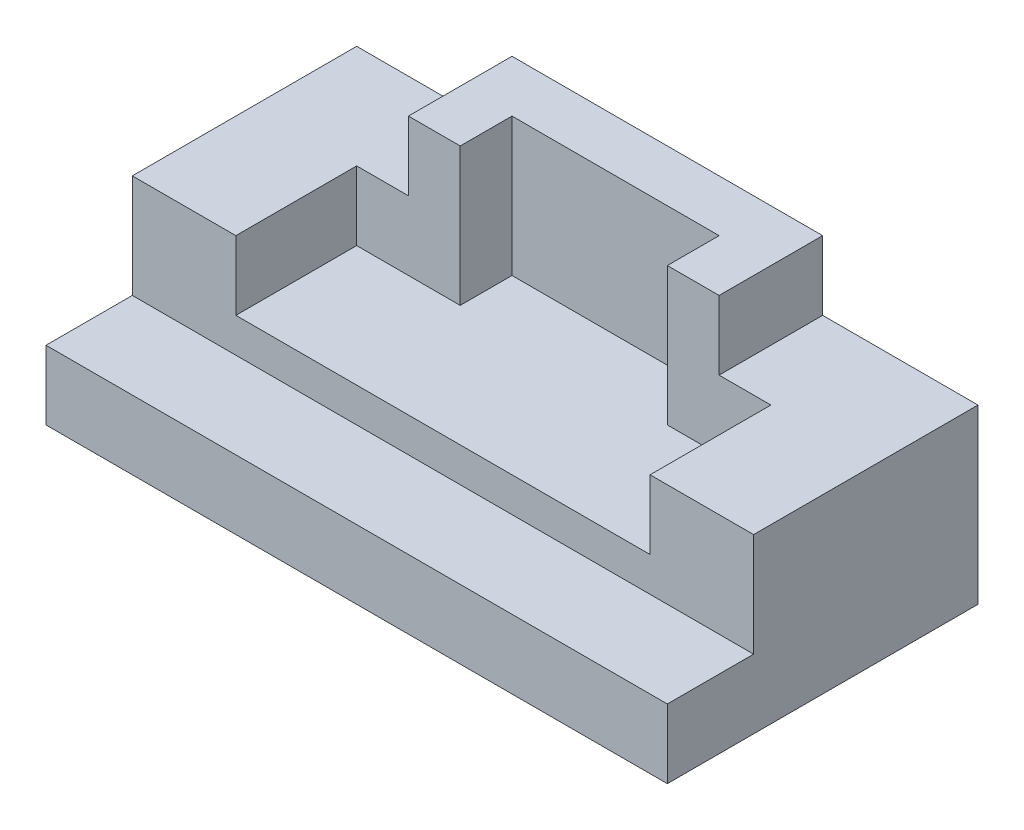
ISO-10303-21;
HEADER;
FILE_DESCRIPTION(('STEP AP214'),'2;1');
FILE_NAME('part.step','',(''),(''),'','','');
FILE_SCHEMA(('AUTOMOTIVE_DESIGN { 1 0 10303 214 1 1 1 1 }'));
ENDSEC;
DATA;
#1=APPLICATION_CONTEXT('core data for automotive mechanical design processes');
#2=APPLICATION_PROTOCOL_DEFINITION('international standard','automotive_design',2000,#1);
#3=PRODUCT_CONTEXT('',#1,'mechanical');
#4=PRODUCT('Part','Part','',(#3));
#5=PRODUCT_RELATED_PRODUCT_CATEGORY('part','',(#4));
#6=PRODUCT_DEFINITION_FORMATION('','',#4);
#7=PRODUCT_DEFINITION_CONTEXT('part definition',#1,'design');
#8=PRODUCT_DEFINITION('design','',#6,#7);
#9=PRODUCT_DEFINITION_SHAPE('','',#8);
#10=(LENGTH_UNIT() NAMED_UNIT(*) SI_UNIT(.MILLI.,.METRE.));
#11=(NAMED_UNIT(*) PLANE_ANGLE_UNIT() SI_UNIT($,.RADIAN.));
#12=(NAMED_UNIT(*) SI_UNIT($,.STERADIAN.) SOLID_ANGLE_UNIT());
#13=UNCERTAINTY_MEASURE_WITH_UNIT(LENGTH_MEASURE(1.E-05),#10,'distance_accuracy_value','');
#14=(GEOMETRIC_REPRESENTATION_CONTEXT(3) GLOBAL_UNCERTAINTY_ASSIGNED_CONTEXT((#13)) GLOBAL_UNIT_ASSIGNED_CONTEXT((#10,
#11,#12)) REPRESENTATION_CONTEXT('',''));
#15=CARTESIAN_POINT('',(0.,0.,0.));
#16=DIRECTION('',(0.,0.,1.));
#17=DIRECTION('',(1.,0.,0.));
#18=AXIS2_PLACEMENT_3D('',#15,#16,#17);
#19=CARTESIAN_POINT('',(57.15,31.75,-28.575));
#20=DIRECTION('',(0.,-1.,0.));
#21=DIRECTION('',(0.,0.,-1.));
#22=AXIS2_PLACEMENT_3D('',#19,#20,#21);
#23=PLANE('',#22);
#24=DIRECTION('',(0.,0.,-1.));
#25=VECTOR('',#24,1.);
#26=CARTESIAN_POINT('',(28.575,31.75,-28.575));
#27=LINE('',#26,#25);
#28=CARTESIAN_POINT('',(28.575,31.75,-9.52500000000001));
#29=VERTEX_POINT('',#28);
#30=CARTESIAN_POINT('',(28.575,31.75,-28.575));
#31=VERTEX_POINT('',#30);
#32=EDGE_CURVE('E224',#29,#31,#27,.T.);
#33=ORIENTED_EDGE('',*,*,#32,.F.);
#34=DIRECTION('',(1.,0.,0.));
#35=VECTOR('',#34,1.);
#36=CARTESIAN_POINT('',(57.15,31.75,-9.52500000000001));
#37=LINE('',#36,#35);
#38=CARTESIAN_POINT('',(38.1,31.75,-9.52500000000001));
#39=VERTEX_POINT('',#38);
#40=EDGE_CURVE('E211',#29,#39,#37,.T.);
#41=ORIENTED_EDGE('',*,*,#40,.T.);
#42=DIRECTION('',(0.,0.,1.));
#43=VECTOR('',#42,1.);
#44=CARTESIAN_POINT('',(38.1,31.75,-28.575));
#45=LINE('',#44,#43);
#46=CARTESIAN_POINT('',(38.1,31.75,12.7));
#47=VERTEX_POINT('',#46);
#48=EDGE_CURVE('E217',#39,#47,#45,.T.);
#49=ORIENTED_EDGE('',*,*,#48,.T.);
#50=DIRECTION('',(-1.,0.,0.));
#51=VECTOR('',#50,1.);
#52=CARTESIAN_POINT('',(57.15,31.75,12.7));
#53=LINE('',#52,#51);
#54=CARTESIAN_POINT('',(57.15,31.75,12.7));
#55=VERTEX_POINT('',#54);
#56=EDGE_CURVE('E264',#55,#47,#53,.T.);
#57=ORIENTED_EDGE('',*,*,#56,.F.);
#58=DIRECTION('',(0.,0.,1.));
#59=VECTOR('',#58,1.);
#60=CARTESIAN_POINT('',(57.15,31.75,-28.575));
#61=LINE('',#60,#59);
#62=CARTESIAN_POINT('',(57.15,31.75,-28.575));
#63=VERTEX_POINT('',#62);
#64=EDGE_CURVE('E279',#63,#55,#61,.T.);
#65=ORIENTED_EDGE('',*,*,#64,.F.);
#66=DIRECTION('',(-1.,0.,0.));
#67=VECTOR('',#66,1.);
#68=CARTESIAN_POINT('',(57.15,31.75,-28.575));
#69=LINE('',#68,#67);
#70=EDGE_CURVE('E263',#63,#31,#69,.T.);
#71=ORIENTED_EDGE('',*,*,#70,.T.);
#72=EDGE_LOOP('',(#33,#41,#49,#57,#65,#71));
#73=FACE_BOUND('',#72,.T.);
#74=ADVANCED_FACE('F33',(#73),#23,.F.);
#75=CARTESIAN_POINT('',(-38.1,31.75,12.7));
#76=VERTEX_POINT('',#75);
#77=CARTESIAN_POINT('',(-57.15,31.75,12.7));
#78=VERTEX_POINT('',#77);
#79=EDGE_CURVE('E292',#76,#78,#53,.T.);
#80=ORIENTED_EDGE('',*,*,#79,.F.);
#81=DIRECTION('',(0.,0.,-1.));
#82=VECTOR('',#81,1.);
#83=CARTESIAN_POINT('',(-38.1,31.75,-28.575));
#84=LINE('',#83,#82);
#85=CARTESIAN_POINT('',(-38.1,31.75,-9.52500000000001));
#86=VERTEX_POINT('',#85);
#87=EDGE_CURVE('E214',#76,#86,#84,.T.);
#88=ORIENTED_EDGE('',*,*,#87,.T.);
#89=DIRECTION('',(1.,0.,0.));
#90=VECTOR('',#89,1.);
#91=CARTESIAN_POINT('',(57.15,31.75,-9.52500000000001));
#92=LINE('',#91,#90);
#93=CARTESIAN_POINT('',(-28.575,31.75,-9.52500000000001));
#94=VERTEX_POINT('',#93);
#95=EDGE_CURVE('E202',#86,#94,#92,.T.);
#96=ORIENTED_EDGE('',*,*,#95,.T.);
#97=DIRECTION('',(0.,0.,1.));
#98=VECTOR('',#97,1.);
#99=CARTESIAN_POINT('',(-28.575,31.75,-9.525));
#100=LINE('',#99,#98);
#101=CARTESIAN_POINT('',(-28.575,31.75,-28.575));
#102=VERTEX_POINT('',#101);
#103=EDGE_CURVE('E58',#102,#94,#100,.T.);
#104=ORIENTED_EDGE('',*,*,#103,.F.);
#105=CARTESIAN_POINT('',(-57.15,31.75,-28.575));
#106=VERTEX_POINT('',#105);
#107=EDGE_CURVE('E260',#102,#106,#69,.T.);
#108=ORIENTED_EDGE('',*,*,#107,.T.);
#109=DIRECTION('',(0.,0.,1.));
#110=VECTOR('',#109,1.);
#111=CARTESIAN_POINT('',(-57.15,31.75,-28.575));
#112=LINE('',#111,#110);
#113=EDGE_CURVE('E310',#106,#78,#112,.T.);
#114=ORIENTED_EDGE('',*,*,#113,.T.);
#115=EDGE_LOOP('',(#80,#88,#96,#104,#108,#114));
#116=FACE_BOUND('',#115,.T.);
#117=ADVANCED_FACE('F362',(#116),#23,.F.);
#118=CARTESIAN_POINT('',(57.15,12.7,28.575));
#119=DIRECTION('',(0.,0.,-1.));
#120=DIRECTION('',(0.,1.,0.));
#121=AXIS2_PLACEMENT_3D('',#118,#119,#120);
#122=PLANE('',#121);
#123=DIRECTION('',(0.,-1.,0.));
#124=VECTOR('',#123,1.);
#125=CARTESIAN_POINT('',(-57.15,12.7,28.575));
#126=LINE('',#125,#124);
#127=CARTESIAN_POINT('',(-57.15,12.7,28.575));
#128=VERTEX_POINT('',#127);
#129=CARTESIAN_POINT('',(-57.15,0.,28.575));
#130=VERTEX_POINT('',#129);
#131=EDGE_CURVE('E316',#128,#130,#126,.T.);
#132=ORIENTED_EDGE('',*,*,#131,.T.);
#133=DIRECTION('',(-1.,0.,0.));
#134=VECTOR('',#133,1.);
#135=CARTESIAN_POINT('',(57.15,0.,28.575));
#136=LINE('',#135,#134);
#137=CARTESIAN_POINT('',(57.15,0.,28.575));
#138=VERTEX_POINT('',#137);
#139=EDGE_CURVE('E11',#138,#130,#136,.T.);
#140=ORIENTED_EDGE('',*,*,#139,.F.);
#141=DIRECTION('',(0.,-1.,0.));
#142=VECTOR('',#141,1.);
#143=CARTESIAN_POINT('',(57.15,12.7,28.575));
#144=LINE('',#143,#142);
#145=CARTESIAN_POINT('',(57.15,12.7,28.575));
#146=VERTEX_POINT('',#145);
#147=EDGE_CURVE('E307',#146,#138,#144,.T.);
#148=ORIENTED_EDGE('',*,*,#147,.F.);
#149=DIRECTION('',(-1.,0.,0.));
#150=VECTOR('',#149,1.);
#151=CARTESIAN_POINT('',(57.15,12.7,28.575));
#152=LINE('',#151,#150);
#153=EDGE_CURVE('E297',#146,#128,#152,.T.);
#154=ORIENTED_EDGE('',*,*,#153,.T.);
#155=EDGE_LOOP('',(#132,#140,#148,#154));
#156=FACE_BOUND('',#155,.T.);
#157=ADVANCED_FACE('F35',(#156),#122,.F.);
#158=CARTESIAN_POINT('',(57.15,0.,28.575));
#159=DIRECTION('',(0.,1.,0.));
#160=DIRECTION('',(0.,0.,1.));
#161=AXIS2_PLACEMENT_3D('',#158,#159,#160);
#162=PLANE('',#161);
#163=DIRECTION('',(0.,0.,-1.));
#164=VECTOR('',#163,1.);
#165=CARTESIAN_POINT('',(-57.15,0.,28.575));
#166=LINE('',#165,#164);
#167=CARTESIAN_POINT('',(-57.15,0.,-28.575));
#168=VERTEX_POINT('',#167);
#169=EDGE_CURVE('E314',#130,#168,#166,.T.);
#170=ORIENTED_EDGE('',*,*,#169,.T.);
#171=DIRECTION('',(-1.,0.,0.));
#172=VECTOR('',#171,1.);
#173=CARTESIAN_POINT('',(57.15,0.,-28.575));
#174=LINE('',#173,#172);
#175=CARTESIAN_POINT('',(57.15,0.,-28.575));
#176=VERTEX_POINT('',#175);
#177=EDGE_CURVE('E42',#176,#168,#174,.T.);
#178=ORIENTED_EDGE('',*,*,#177,.F.);
#179=DIRECTION('',(0.,0.,-1.));
#180=VECTOR('',#179,1.);
#181=CARTESIAN_POINT('',(57.15,0.,28.575));
#182=LINE('',#181,#180);
#183=EDGE_CURVE('E325',#138,#176,#182,.T.);
#184=ORIENTED_EDGE('',*,*,#183,.F.);
#185=ORIENTED_EDGE('',*,*,#139,.T.);
#186=EDGE_LOOP('',(#170,#178,#184,#185));
#187=FACE_BOUND('',#186,.T.);
#188=ADVANCED_FACE('F372',(#187),#162,.F.);
#189=CARTESIAN_POINT('',(57.15,0.,-28.575));
#190=DIRECTION('',(0.,0.,1.));
#191=DIRECTION('',(1.,0.,0.));
#192=AXIS2_PLACEMENT_3D('',#189,#190,#191);
#193=PLANE('',#192);
#194=DIRECTION('',(0.,1.,0.));
#195=VECTOR('',#194,1.);
#196=CARTESIAN_POINT('',(-57.15,0.,-28.575));
#197=LINE('',#196,#195);
#198=EDGE_CURVE('E312',#168,#106,#197,.T.);
#199=ORIENTED_EDGE('',*,*,#198,.T.);
#200=ORIENTED_EDGE('',*,*,#107,.F.);
#201=DIRECTION('',(0.,-1.,0.));
#202=VECTOR('',#201,1.);
#203=CARTESIAN_POINT('',(-28.575,44.45,-28.575));
#204=LINE('',#203,#202);
#205=CARTESIAN_POINT('',(-28.575,44.45,-28.575));
#206=VERTEX_POINT('',#205);
#207=EDGE_CURVE('E237',#206,#102,#204,.T.);
#208=ORIENTED_EDGE('',*,*,#207,.F.);
#209=DIRECTION('',(-1.,0.,0.));
#210=VECTOR('',#209,1.);
#211=CARTESIAN_POINT('',(-28.575,44.45,-28.575));
#212=LINE('',#211,#210);
#213=CARTESIAN_POINT('',(28.575,44.45,-28.575));
#214=VERTEX_POINT('',#213);
#215=EDGE_CURVE('E235',#214,#206,#212,.T.);
#216=ORIENTED_EDGE('',*,*,#215,.F.);
#217=DIRECTION('',(0.,-1.,0.));
#218=VECTOR('',#217,1.);
#219=CARTESIAN_POINT('',(28.575,44.45,-28.575));
#220=LINE('',#219,#218);
#221=EDGE_CURVE('E245',#214,#31,#220,.T.);
#222=ORIENTED_EDGE('',*,*,#221,.T.);
#223=ORIENTED_EDGE('',*,*,#70,.F.);
#224=DIRECTION('',(0.,1.,0.));
#225=VECTOR('',#224,1.);
#226=CARTESIAN_POINT('',(57.15,0.,-28.575));
#227=LINE('',#226,#225);
#228=EDGE_CURVE('E323',#176,#63,#227,.T.);
#229=ORIENTED_EDGE('',*,*,#228,.F.);
#230=ORIENTED_EDGE('',*,*,#177,.T.);
#231=EDGE_LOOP('',(#199,#200,#208,#216,#222,#223,#229,#230));
#232=FACE_BOUND('',#231,.T.);
#233=ADVANCED_FACE('F370',(#232),#193,.F.);
#234=CARTESIAN_POINT('',(57.15,31.75,12.7));
#235=DIRECTION('',(0.,0.,-1.));
#236=DIRECTION('',(0.,1.,0.));
#237=AXIS2_PLACEMENT_3D('',#234,#235,#236);
#238=PLANE('',#237);
#239=ORIENTED_EDGE('',*,*,#56,.T.);
#240=DIRECTION('',(0.,1.,0.));
#241=VECTOR('',#240,1.);
#242=CARTESIAN_POINT('',(38.1,19.05,12.7));
#243=LINE('',#242,#241);
#244=CARTESIAN_POINT('',(38.1,19.05,12.7));
#245=VERTEX_POINT('',#244);
#246=EDGE_CURVE('E203',#245,#47,#243,.T.);
#247=ORIENTED_EDGE('',*,*,#246,.F.);
#248=DIRECTION('',(1.,0.,0.));
#249=VECTOR('',#248,1.);
#250=CARTESIAN_POINT('',(38.1,19.05,12.7));
#251=LINE('',#250,#249);
#252=CARTESIAN_POINT('',(-38.1,19.05,12.7));
#253=VERTEX_POINT('',#252);
#254=EDGE_CURVE('E196',#253,#245,#251,.T.);
#255=ORIENTED_EDGE('',*,*,#254,.F.);
#256=DIRECTION('',(0.,1.,0.));
#257=VECTOR('',#256,1.);
#258=CARTESIAN_POINT('',(-38.1,19.05,12.7));
#259=LINE('',#258,#257);
#260=EDGE_CURVE('E205',#253,#76,#259,.T.);
#261=ORIENTED_EDGE('',*,*,#260,.T.);
#262=ORIENTED_EDGE('',*,*,#79,.T.);
#263=DIRECTION('',(0.,-1.,0.));
#264=VECTOR('',#263,1.);
#265=CARTESIAN_POINT('',(-57.15,31.75,12.7));
#266=LINE('',#265,#264);
#267=CARTESIAN_POINT('',(-57.15,12.7,12.7));
#268=VERTEX_POINT('',#267);
#269=EDGE_CURVE('E308',#78,#268,#266,.T.);
#270=ORIENTED_EDGE('',*,*,#269,.T.);
#271=DIRECTION('',(-1.,0.,0.));
#272=VECTOR('',#271,1.);
#273=CARTESIAN_POINT('',(57.15,12.7,12.7));
#274=LINE('',#273,#272);
#275=CARTESIAN_POINT('',(57.15,12.7,12.7));
#276=VERTEX_POINT('',#275);
#277=EDGE_CURVE('E293',#276,#268,#274,.T.);
#278=ORIENTED_EDGE('',*,*,#277,.F.);
#279=DIRECTION('',(0.,-1.,0.));
#280=VECTOR('',#279,1.);
#281=CARTESIAN_POINT('',(57.15,31.75,12.7));
#282=LINE('',#281,#280);
#283=EDGE_CURVE('E291',#55,#276,#282,.T.);
#284=ORIENTED_EDGE('',*,*,#283,.F.);
#285=EDGE_LOOP('',(#239,#247,#255,#261,#262,#270,#278,#284));
#286=FACE_BOUND('',#285,.T.);
#287=ADVANCED_FACE('F288',(#286),#238,.F.);
#288=CARTESIAN_POINT('',(57.15,12.7,12.7));
#289=DIRECTION('',(0.,-1.,0.));
#290=DIRECTION('',(0.,0.,-1.));
#291=AXIS2_PLACEMENT_3D('',#288,#289,#290);
#292=PLANE('',#291);
#293=DIRECTION('',(0.,0.,1.));
#294=VECTOR('',#293,1.);
#295=CARTESIAN_POINT('',(-57.15,12.7,12.7));
#296=LINE('',#295,#294);
#297=EDGE_CURVE('E305',#268,#128,#296,.T.);
#298=ORIENTED_EDGE('',*,*,#297,.T.);
#299=ORIENTED_EDGE('',*,*,#153,.F.);
#300=DIRECTION('',(0.,0.,1.));
#301=VECTOR('',#300,1.);
#302=CARTESIAN_POINT('',(57.15,12.7,12.7));
#303=LINE('',#302,#301);
#304=EDGE_CURVE('E302',#276,#146,#303,.T.);
#305=ORIENTED_EDGE('',*,*,#304,.F.);
#306=ORIENTED_EDGE('',*,*,#277,.T.);
#307=EDGE_LOOP('',(#298,#299,#305,#306));
#308=FACE_BOUND('',#307,.T.);
#309=ADVANCED_FACE('F386',(#308),#292,.F.);
#310=CARTESIAN_POINT('',(57.15,0.,0.));
#311=DIRECTION('',(1.,0.,0.));
#312=DIRECTION('',(0.,0.,-1.));
#313=AXIS2_PLACEMENT_3D('',#310,#311,#312);
#314=PLANE('',#313);
#315=ORIENTED_EDGE('',*,*,#147,.T.);
#316=ORIENTED_EDGE('',*,*,#183,.T.);
#317=ORIENTED_EDGE('',*,*,#228,.T.);
#318=ORIENTED_EDGE('',*,*,#64,.T.);
#319=ORIENTED_EDGE('',*,*,#283,.T.);
#320=ORIENTED_EDGE('',*,*,#304,.T.);
#321=EDGE_LOOP('',(#315,#316,#317,#318,#319,#320));
#322=FACE_BOUND('',#321,.T.);
#323=ADVANCED_FACE('F389',(#322),#314,.T.);
#324=CARTESIAN_POINT('',(-57.15,0.,0.));
#325=DIRECTION('',(1.,0.,0.));
#326=DIRECTION('',(0.,0.,-1.));
#327=AXIS2_PLACEMENT_3D('',#324,#325,#326);
#328=PLANE('',#327);
#329=ORIENTED_EDGE('',*,*,#131,.F.);
#330=ORIENTED_EDGE('',*,*,#297,.F.);
#331=ORIENTED_EDGE('',*,*,#269,.F.);
#332=ORIENTED_EDGE('',*,*,#113,.F.);
#333=ORIENTED_EDGE('',*,*,#198,.F.);
#334=ORIENTED_EDGE('',*,*,#169,.F.);
#335=EDGE_LOOP('',(#329,#330,#331,#332,#333,#334));
#336=FACE_BOUND('',#335,.T.);
#337=ADVANCED_FACE('F382',(#336),#328,.F.);
#338=CARTESIAN_POINT('',(-28.575,44.45,-9.525));
#339=DIRECTION('',(1.,0.,0.));
#340=DIRECTION('',(0.,0.,-1.));
#341=AXIS2_PLACEMENT_3D('',#338,#339,#340);
#342=PLANE('',#341);
#343=ORIENTED_EDGE('',*,*,#103,.T.);
#344=DIRECTION('',(0.,-1.,0.));
#345=VECTOR('',#344,1.);
#346=CARTESIAN_POINT('',(-28.575,44.45,-9.525));
#347=LINE('',#346,#345);
#348=CARTESIAN_POINT('',(-28.575,44.45,-9.525));
#349=VERTEX_POINT('',#348);
#350=EDGE_CURVE('E319',#349,#94,#347,.T.);
#351=ORIENTED_EDGE('',*,*,#350,.F.);
#352=DIRECTION('',(0.,0.,1.));
#353=VECTOR('',#352,1.);
#354=CARTESIAN_POINT('',(-28.575,44.45,-9.525));
#355=LINE('',#354,#353);
#356=EDGE_CURVE('E220',#206,#349,#355,.T.);
#357=ORIENTED_EDGE('',*,*,#356,.F.);
#358=ORIENTED_EDGE('',*,*,#207,.T.);
#359=EDGE_LOOP('',(#343,#351,#357,#358));
#360=FACE_BOUND('',#359,.T.);
#361=ADVANCED_FACE('F396',(#360),#342,.F.);
#362=CARTESIAN_POINT('',(-19.05,44.45,-9.525));
#363=DIRECTION('',(0.,0.,-1.));
#364=DIRECTION('',(0.,1.,0.));
#365=AXIS2_PLACEMENT_3D('',#362,#363,#364);
#366=PLANE('',#365);
#367=ORIENTED_EDGE('',*,*,#350,.T.);
#368=ORIENTED_EDGE('',*,*,#95,.F.);
#369=DIRECTION('',(0.,1.,0.));
#370=VECTOR('',#369,1.);
#371=CARTESIAN_POINT('',(-38.1,19.05,-9.52500000000001));
#372=LINE('',#371,#370);
#373=CARTESIAN_POINT('',(-38.1,19.05,-9.52500000000001));
#374=VERTEX_POINT('',#373);
#375=EDGE_CURVE('E199',#374,#86,#372,.T.);
#376=ORIENTED_EDGE('',*,*,#375,.F.);
#377=DIRECTION('',(-1.,0.,0.));
#378=VECTOR('',#377,1.);
#379=CARTESIAN_POINT('',(-38.1,19.05,-9.52500000000001));
#380=LINE('',#379,#378);
#381=CARTESIAN_POINT('',(-19.05,19.05,-9.52500000000001));
#382=VERTEX_POINT('',#381);
#383=EDGE_CURVE('E193',#382,#374,#380,.T.);
#384=ORIENTED_EDGE('',*,*,#383,.F.);
#385=DIRECTION('',(0.,-1.,0.));
#386=VECTOR('',#385,1.);
#387=CARTESIAN_POINT('',(-19.05,44.45,-9.525));
#388=LINE('',#387,#386);
#389=CARTESIAN_POINT('',(-19.05,44.45,-9.525));
#390=VERTEX_POINT('',#389);
#391=EDGE_CURVE('E331',#390,#382,#388,.T.);
#392=ORIENTED_EDGE('',*,*,#391,.F.);
#393=DIRECTION('',(1.,0.,0.));
#394=VECTOR('',#393,1.);
#395=CARTESIAN_POINT('',(-19.05,44.45,-9.525));
#396=LINE('',#395,#394);
#397=EDGE_CURVE('E223',#349,#390,#396,.T.);
#398=ORIENTED_EDGE('',*,*,#397,.F.);
#399=EDGE_LOOP('',(#367,#368,#376,#384,#392,#398));
#400=FACE_BOUND('',#399,.T.);
#401=ADVANCED_FACE('F346',(#400),#366,.F.);
#402=CARTESIAN_POINT('',(-19.05,44.45,-19.05));
#403=DIRECTION('',(-1.,0.,0.));
#404=DIRECTION('',(0.,0.,1.));
#405=AXIS2_PLACEMENT_3D('',#402,#403,#404);
#406=PLANE('',#405);
#407=ORIENTED_EDGE('',*,*,#391,.T.);
#408=DIRECTION('',(0.,0.,1.));
#409=VECTOR('',#408,1.);
#410=CARTESIAN_POINT('',(-19.05,19.05,-9.52500000000001));
#411=LINE('',#410,#409);
#412=CARTESIAN_POINT('',(-19.05,19.05,-19.05));
#413=VERTEX_POINT('',#412);
#414=EDGE_CURVE('E190',#413,#382,#411,.T.);
#415=ORIENTED_EDGE('',*,*,#414,.F.);
#416=DIRECTION('',(0.,-1.,0.));
#417=VECTOR('',#416,1.);
#418=CARTESIAN_POINT('',(-19.05,44.45,-19.05));
#419=LINE('',#418,#417);
#420=CARTESIAN_POINT('',(-19.05,44.45,-19.05));
#421=VERTEX_POINT('',#420);
#422=EDGE_CURVE('E333',#421,#413,#419,.T.);
#423=ORIENTED_EDGE('',*,*,#422,.F.);
#424=DIRECTION('',(0.,0.,-1.));
#425=VECTOR('',#424,1.);
#426=CARTESIAN_POINT('',(-19.05,44.45,-19.05));
#427=LINE('',#426,#425);
#428=EDGE_CURVE('E226',#390,#421,#427,.T.);
#429=ORIENTED_EDGE('',*,*,#428,.F.);
#430=EDGE_LOOP('',(#407,#415,#423,#429));
#431=FACE_BOUND('',#430,.T.);
#432=ADVANCED_FACE('F342',(#431),#406,.F.);
#433=CARTESIAN_POINT('',(19.05,44.45,-19.05));
#434=DIRECTION('',(0.,0.,-1.));
#435=DIRECTION('',(0.,1.,0.));
#436=AXIS2_PLACEMENT_3D('',#433,#434,#435);
#437=PLANE('',#436);
#438=ORIENTED_EDGE('',*,*,#422,.T.);
#439=DIRECTION('',(-1.,0.,0.));
#440=VECTOR('',#439,1.);
#441=CARTESIAN_POINT('',(-19.05,19.05,-19.05));
#442=LINE('',#441,#440);
#443=CARTESIAN_POINT('',(19.05,19.05,-19.05));
#444=VERTEX_POINT('',#443);
#445=EDGE_CURVE('E182',#444,#413,#442,.T.);
#446=ORIENTED_EDGE('',*,*,#445,.F.);
#447=DIRECTION('',(0.,-1.,0.));
#448=VECTOR('',#447,1.);
#449=CARTESIAN_POINT('',(19.05,44.45,-19.05));
#450=LINE('',#449,#448);
#451=CARTESIAN_POINT('',(19.05,44.45,-19.05));
#452=VERTEX_POINT('',#451);
#453=EDGE_CURVE('E173',#452,#444,#450,.T.);
#454=ORIENTED_EDGE('',*,*,#453,.F.);
#455=DIRECTION('',(1.,0.,0.));
#456=VECTOR('',#455,1.);
#457=CARTESIAN_POINT('',(19.05,44.45,-19.05));
#458=LINE('',#457,#456);
#459=EDGE_CURVE('E228',#421,#452,#458,.T.);
#460=ORIENTED_EDGE('',*,*,#459,.F.);
#461=EDGE_LOOP('',(#438,#446,#454,#460));
#462=FACE_BOUND('',#461,.T.);
#463=ADVANCED_FACE('F339',(#462),#437,.F.);
#464=CARTESIAN_POINT('',(19.05,44.45,-9.525));
#465=DIRECTION('',(1.,0.,0.));
#466=DIRECTION('',(0.,0.,-1.));
#467=AXIS2_PLACEMENT_3D('',#464,#465,#466);
#468=PLANE('',#467);
#469=ORIENTED_EDGE('',*,*,#453,.T.);
#470=DIRECTION('',(0.,0.,-1.));
#471=VECTOR('',#470,1.);
#472=CARTESIAN_POINT('',(19.05,19.05,-19.05));
#473=LINE('',#472,#471);
#474=CARTESIAN_POINT('',(19.05,19.05,-9.52500000000001));
#475=VERTEX_POINT('',#474);
#476=EDGE_CURVE('E177',#475,#444,#473,.T.);
#477=ORIENTED_EDGE('',*,*,#476,.F.);
#478=DIRECTION('',(0.,-1.,0.));
#479=VECTOR('',#478,1.);
#480=CARTESIAN_POINT('',(19.05,44.45,-9.525));
#481=LINE('',#480,#479);
#482=CARTESIAN_POINT('',(19.05,44.45,-9.525));
#483=VERTEX_POINT('',#482);
#484=EDGE_CURVE('E162',#483,#475,#481,.T.);
#485=ORIENTED_EDGE('',*,*,#484,.F.);
#486=DIRECTION('',(0.,0.,1.));
#487=VECTOR('',#486,1.);
#488=CARTESIAN_POINT('',(19.05,44.45,-9.525));
#489=LINE('',#488,#487);
#490=EDGE_CURVE('E230',#452,#483,#489,.T.);
#491=ORIENTED_EDGE('',*,*,#490,.F.);
#492=EDGE_LOOP('',(#469,#477,#485,#491));
#493=FACE_BOUND('',#492,.T.);
#494=ADVANCED_FACE('F178',(#493),#468,.F.);
#495=CARTESIAN_POINT('',(28.575,44.45,-9.525));
#496=DIRECTION('',(0.,0.,-1.));
#497=DIRECTION('',(0.,1.,0.));
#498=AXIS2_PLACEMENT_3D('',#495,#496,#497);
#499=PLANE('',#498);
#500=ORIENTED_EDGE('',*,*,#484,.T.);
#501=DIRECTION('',(-1.,0.,0.));
#502=VECTOR('',#501,1.);
#503=CARTESIAN_POINT('',(19.05,19.05,-9.52500000000001));
#504=LINE('',#503,#502);
#505=CARTESIAN_POINT('',(38.1,19.05,-9.52500000000001));
#506=VERTEX_POINT('',#505);
#507=EDGE_CURVE('E167',#506,#475,#504,.T.);
#508=ORIENTED_EDGE('',*,*,#507,.F.);
#509=DIRECTION('',(0.,1.,0.));
#510=VECTOR('',#509,1.);
#511=CARTESIAN_POINT('',(38.1,19.05,-9.52500000000001));
#512=LINE('',#511,#510);
#513=EDGE_CURVE('E200',#506,#39,#512,.T.);
#514=ORIENTED_EDGE('',*,*,#513,.T.);
#515=ORIENTED_EDGE('',*,*,#40,.F.);
#516=DIRECTION('',(0.,-1.,0.));
#517=VECTOR('',#516,1.);
#518=CARTESIAN_POINT('',(28.575,44.45,-9.525));
#519=LINE('',#518,#517);
#520=CARTESIAN_POINT('',(28.575,44.45,-9.525));
#521=VERTEX_POINT('',#520);
#522=EDGE_CURVE('E174',#521,#29,#519,.T.);
#523=ORIENTED_EDGE('',*,*,#522,.F.);
#524=DIRECTION('',(1.,0.,0.));
#525=VECTOR('',#524,1.);
#526=CARTESIAN_POINT('',(28.575,44.45,-9.525));
#527=LINE('',#526,#525);
#528=EDGE_CURVE('E170',#483,#521,#527,.T.);
#529=ORIENTED_EDGE('',*,*,#528,.F.);
#530=EDGE_LOOP('',(#500,#508,#514,#515,#523,#529));
#531=FACE_BOUND('',#530,.T.);
#532=ADVANCED_FACE('F164',(#531),#499,.F.);
#533=CARTESIAN_POINT('',(28.575,44.45,-28.575));
#534=DIRECTION('',(-1.,0.,0.));
#535=DIRECTION('',(0.,0.,1.));
#536=AXIS2_PLACEMENT_3D('',#533,#534,#535);
#537=PLANE('',#536);
#538=ORIENTED_EDGE('',*,*,#32,.T.);
#539=ORIENTED_EDGE('',*,*,#221,.F.);
#540=DIRECTION('',(0.,0.,-1.));
#541=VECTOR('',#540,1.);
#542=CARTESIAN_POINT('',(28.575,44.45,-28.575));
#543=LINE('',#542,#541);
#544=EDGE_CURVE('E233',#521,#214,#543,.T.);
#545=ORIENTED_EDGE('',*,*,#544,.F.);
#546=ORIENTED_EDGE('',*,*,#522,.T.);
#547=EDGE_LOOP('',(#538,#539,#545,#546));
#548=FACE_BOUND('',#547,.T.);
#549=ADVANCED_FACE('F281',(#548),#537,.F.);
#550=CARTESIAN_POINT('',(0.,44.45,0.));
#551=DIRECTION('',(0.,-1.,0.));
#552=DIRECTION('',(0.,0.,-1.));
#553=AXIS2_PLACEMENT_3D('',#550,#551,#552);
#554=PLANE('',#553);
#555=ORIENTED_EDGE('',*,*,#356,.T.);
#556=ORIENTED_EDGE('',*,*,#397,.T.);
#557=ORIENTED_EDGE('',*,*,#428,.T.);
#558=ORIENTED_EDGE('',*,*,#459,.T.);
#559=ORIENTED_EDGE('',*,*,#490,.T.);
#560=ORIENTED_EDGE('',*,*,#528,.T.);
#561=ORIENTED_EDGE('',*,*,#544,.T.);
#562=ORIENTED_EDGE('',*,*,#215,.T.);
#563=EDGE_LOOP('',(#555,#556,#557,#558,#559,#560,#561,#562));
#564=FACE_BOUND('',#563,.T.);
#565=ADVANCED_FACE('F351',(#564),#554,.F.);
#566=CARTESIAN_POINT('',(38.1,19.05,-9.52500000000001));
#567=DIRECTION('',(1.,0.,0.));
#568=DIRECTION('',(0.,0.,-1.));
#569=AXIS2_PLACEMENT_3D('',#566,#567,#568);
#570=PLANE('',#569);
#571=ORIENTED_EDGE('',*,*,#513,.F.);
#572=DIRECTION('',(0.,0.,-1.));
#573=VECTOR('',#572,1.);
#574=CARTESIAN_POINT('',(38.1,19.05,-9.52500000000001));
#575=LINE('',#574,#573);
#576=EDGE_CURVE('E186',#245,#506,#575,.T.);
#577=ORIENTED_EDGE('',*,*,#576,.F.);
#578=ORIENTED_EDGE('',*,*,#246,.T.);
#579=ORIENTED_EDGE('',*,*,#48,.F.);
#580=EDGE_LOOP('',(#571,#577,#578,#579));
#581=FACE_BOUND('',#580,.T.);
#582=ADVANCED_FACE('F349',(#581),#570,.F.);
#583=CARTESIAN_POINT('',(-38.1,19.05,12.7));
#584=DIRECTION('',(-1.,0.,0.));
#585=DIRECTION('',(0.,0.,1.));
#586=AXIS2_PLACEMENT_3D('',#583,#584,#585);
#587=PLANE('',#586);
#588=ORIENTED_EDGE('',*,*,#260,.F.);
#589=DIRECTION('',(0.,0.,1.));
#590=VECTOR('',#589,1.);
#591=CARTESIAN_POINT('',(-38.1,19.05,12.7));
#592=LINE('',#591,#590);
#593=EDGE_CURVE('E50',#374,#253,#592,.T.);
#594=ORIENTED_EDGE('',*,*,#593,.F.);
#595=ORIENTED_EDGE('',*,*,#375,.T.);
#596=ORIENTED_EDGE('',*,*,#87,.F.);
#597=EDGE_LOOP('',(#588,#594,#595,#596));
#598=FACE_BOUND('',#597,.T.);
#599=ADVANCED_FACE('F348',(#598),#587,.F.);
#600=CARTESIAN_POINT('',(0.,19.05,0.));
#601=DIRECTION('',(0.,-1.,0.));
#602=DIRECTION('',(0.,0.,-1.));
#603=AXIS2_PLACEMENT_3D('',#600,#601,#602);
#604=PLANE('',#603);
#605=ORIENTED_EDGE('',*,*,#507,.T.);
#606=ORIENTED_EDGE('',*,*,#476,.T.);
#607=ORIENTED_EDGE('',*,*,#445,.T.);
#608=ORIENTED_EDGE('',*,*,#414,.T.);
#609=ORIENTED_EDGE('',*,*,#383,.T.);
#610=ORIENTED_EDGE('',*,*,#593,.T.);
#611=ORIENTED_EDGE('',*,*,#254,.T.);
#612=ORIENTED_EDGE('',*,*,#576,.T.);
#613=EDGE_LOOP('',(#605,#606,#607,#608,#609,#610,#611,#612));
#614=FACE_BOUND('',#613,.T.);
#615=ADVANCED_FACE('F184',(#614),#604,.F.);
#616=CLOSED_SHELL('',(#74,#117,#157,#188,#233,#287,#309,#323,#337,#361,#401,#432,#463,#494,#532,
#549,#565,#582,#599,#615));
#617=MANIFOLD_SOLID_BREP('B2',#616);
#618=ADVANCED_BREP_SHAPE_REPRESENTATION('',(#18,#617),#14);
#619=SHAPE_DEFINITION_REPRESENTATION(#9,#618);
ENDSEC;
END-ISO-10303-21;
